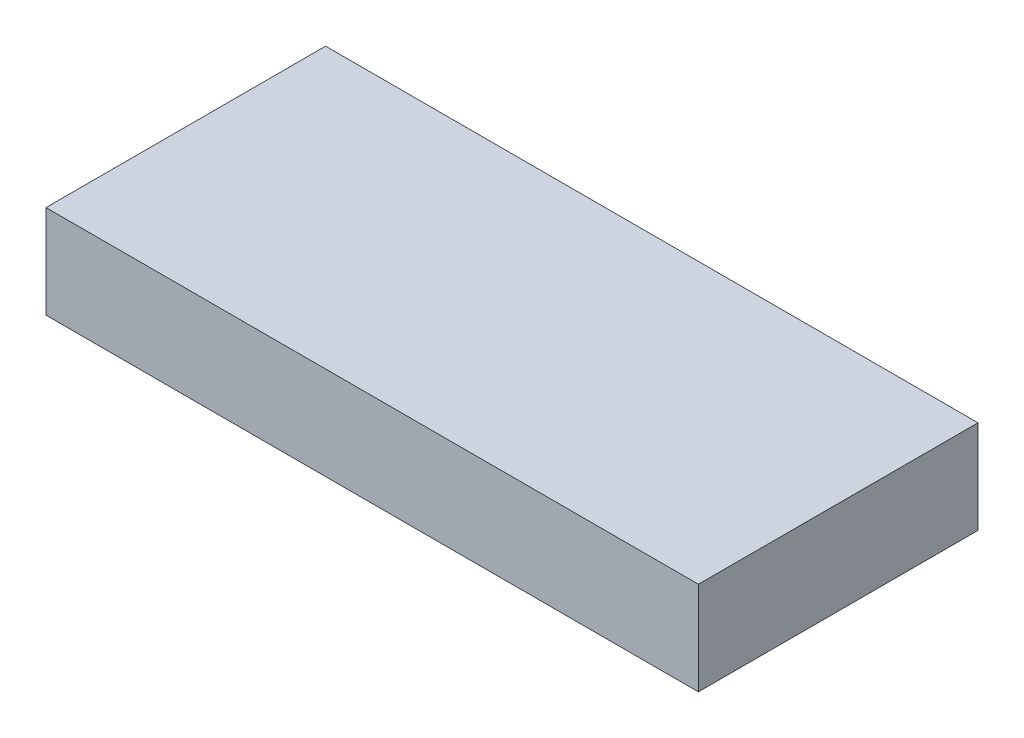
ISO-10303-21;
HEADER;
FILE_DESCRIPTION(('STEP AP214'),'2;1');
FILE_NAME('part.step','',(''),(''),'','','');
FILE_SCHEMA(('AUTOMOTIVE_DESIGN { 1 0 10303 214 1 1 1 1 }'));
ENDSEC;
DATA;
#1=APPLICATION_CONTEXT('core data for automotive mechanical design processes');
#2=APPLICATION_PROTOCOL_DEFINITION('international standard','automotive_design',2000,#1);
#3=PRODUCT_CONTEXT('',#1,'mechanical');
#4=PRODUCT('Part','Part','',(#3));
#5=PRODUCT_RELATED_PRODUCT_CATEGORY('part','',(#4));
#6=PRODUCT_DEFINITION_FORMATION('','',#4);
#7=PRODUCT_DEFINITION_CONTEXT('part definition',#1,'design');
#8=PRODUCT_DEFINITION('design','',#6,#7);
#9=PRODUCT_DEFINITION_SHAPE('','',#8);
#10=(LENGTH_UNIT() NAMED_UNIT(*) SI_UNIT(.MILLI.,.METRE.));
#11=(NAMED_UNIT(*) PLANE_ANGLE_UNIT() SI_UNIT($,.RADIAN.));
#12=(NAMED_UNIT(*) SI_UNIT($,.STERADIAN.) SOLID_ANGLE_UNIT());
#13=UNCERTAINTY_MEASURE_WITH_UNIT(LENGTH_MEASURE(1.E-05),#10,'distance_accuracy_value','');
#14=(GEOMETRIC_REPRESENTATION_CONTEXT(3) GLOBAL_UNCERTAINTY_ASSIGNED_CONTEXT((#13)) GLOBAL_UNIT_ASSIGNED_CONTEXT((#10,
#11,#12)) REPRESENTATION_CONTEXT('',''));
#15=CARTESIAN_POINT('',(0.,0.,0.));
#16=DIRECTION('',(0.,0.,1.));
#17=DIRECTION('',(1.,0.,0.));
#18=AXIS2_PLACEMENT_3D('',#15,#16,#17);
#19=CARTESIAN_POINT('',(17.5,5.,-7.5));
#20=DIRECTION('',(-1.,0.,0.));
#21=DIRECTION('',(0.,0.,1.));
#22=AXIS2_PLACEMENT_3D('',#19,#20,#21);
#23=PLANE('',#22);
#24=DIRECTION('',(0.,0.,-1.));
#25=VECTOR('',#24,1.);
#26=CARTESIAN_POINT('',(17.5,0.,-7.5));
#27=LINE('',#26,#25);
#28=CARTESIAN_POINT('',(17.5,0.,7.50000000000001));
#29=VERTEX_POINT('',#28);
#30=CARTESIAN_POINT('',(17.5,0.,-7.5));
#31=VERTEX_POINT('',#30);
#32=EDGE_CURVE('E111',#29,#31,#27,.T.);
#33=ORIENTED_EDGE('',*,*,#32,.T.);
#34=DIRECTION('',(0.,-1.,0.));
#35=VECTOR('',#34,1.);
#36=CARTESIAN_POINT('',(17.5,5.,-7.5));
#37=LINE('',#36,#35);
#38=CARTESIAN_POINT('',(17.5,5.,-7.5));
#39=VERTEX_POINT('',#38);
#40=EDGE_CURVE('E11',#39,#31,#37,.T.);
#41=ORIENTED_EDGE('',*,*,#40,.F.);
#42=DIRECTION('',(0.,0.,-1.));
#43=VECTOR('',#42,1.);
#44=CARTESIAN_POINT('',(17.5,5.,-7.5));
#45=LINE('',#44,#43);
#46=CARTESIAN_POINT('',(17.5,5.,7.50000000000001));
#47=VERTEX_POINT('',#46);
#48=EDGE_CURVE('E95',#47,#39,#45,.T.);
#49=ORIENTED_EDGE('',*,*,#48,.F.);
#50=DIRECTION('',(0.,-1.,0.));
#51=VECTOR('',#50,1.);
#52=CARTESIAN_POINT('',(17.5,5.,7.50000000000001));
#53=LINE('',#52,#51);
#54=EDGE_CURVE('E107',#47,#29,#53,.T.);
#55=ORIENTED_EDGE('',*,*,#54,.T.);
#56=EDGE_LOOP('',(#33,#41,#49,#55));
#57=FACE_BOUND('',#56,.T.);
#58=ADVANCED_FACE('F43',(#57),#23,.F.);
#59=CARTESIAN_POINT('',(-17.5,5.,-7.5));
#60=DIRECTION('',(0.,0.,1.));
#61=DIRECTION('',(1.,0.,0.));
#62=AXIS2_PLACEMENT_3D('',#59,#60,#61);
#63=PLANE('',#62);
#64=DIRECTION('',(-1.,0.,0.));
#65=VECTOR('',#64,1.);
#66=CARTESIAN_POINT('',(-17.5,0.,-7.5));
#67=LINE('',#66,#65);
#68=CARTESIAN_POINT('',(-17.5,0.,-7.5));
#69=VERTEX_POINT('',#68);
#70=EDGE_CURVE('E100',#31,#69,#67,.T.);
#71=ORIENTED_EDGE('',*,*,#70,.T.);
#72=DIRECTION('',(0.,-1.,0.));
#73=VECTOR('',#72,1.);
#74=CARTESIAN_POINT('',(-17.5,5.,-7.5));
#75=LINE('',#74,#73);
#76=CARTESIAN_POINT('',(-17.5,5.,-7.5));
#77=VERTEX_POINT('',#76);
#78=EDGE_CURVE('E52',#77,#69,#75,.T.);
#79=ORIENTED_EDGE('',*,*,#78,.F.);
#80=DIRECTION('',(-1.,0.,0.));
#81=VECTOR('',#80,1.);
#82=CARTESIAN_POINT('',(-17.5,5.,-7.5));
#83=LINE('',#82,#81);
#84=EDGE_CURVE('E90',#39,#77,#83,.T.);
#85=ORIENTED_EDGE('',*,*,#84,.F.);
#86=ORIENTED_EDGE('',*,*,#40,.T.);
#87=EDGE_LOOP('',(#71,#79,#85,#86));
#88=FACE_BOUND('',#87,.T.);
#89=ADVANCED_FACE('F99',(#88),#63,.F.);
#90=CARTESIAN_POINT('',(-17.5,5.,-7.5));
#91=DIRECTION('',(1.,0.,0.));
#92=DIRECTION('',(0.,0.,-1.));
#93=AXIS2_PLACEMENT_3D('',#90,#91,#92);
#94=PLANE('',#93);
#95=DIRECTION('',(0.,0.,1.));
#96=VECTOR('',#95,1.);
#97=CARTESIAN_POINT('',(-17.5,0.,-7.5));
#98=LINE('',#97,#96);
#99=CARTESIAN_POINT('',(-17.5,0.,7.50000000000001));
#100=VERTEX_POINT('',#99);
#101=EDGE_CURVE('E77',#69,#100,#98,.T.);
#102=ORIENTED_EDGE('',*,*,#101,.T.);
#103=DIRECTION('',(0.,-1.,0.));
#104=VECTOR('',#103,1.);
#105=CARTESIAN_POINT('',(-17.5,5.,7.50000000000001));
#106=LINE('',#105,#104);
#107=CARTESIAN_POINT('',(-17.5,5.,7.50000000000001));
#108=VERTEX_POINT('',#107);
#109=EDGE_CURVE('E102',#108,#100,#106,.T.);
#110=ORIENTED_EDGE('',*,*,#109,.F.);
#111=DIRECTION('',(0.,0.,1.));
#112=VECTOR('',#111,1.);
#113=CARTESIAN_POINT('',(-17.5,5.,-7.5));
#114=LINE('',#113,#112);
#115=EDGE_CURVE('E93',#77,#108,#114,.T.);
#116=ORIENTED_EDGE('',*,*,#115,.F.);
#117=ORIENTED_EDGE('',*,*,#78,.T.);
#118=EDGE_LOOP('',(#102,#110,#116,#117));
#119=FACE_BOUND('',#118,.T.);
#120=ADVANCED_FACE('F103',(#119),#94,.F.);
#121=CARTESIAN_POINT('',(-17.5,5.,7.50000000000001));
#122=DIRECTION('',(0.,0.,-1.));
#123=DIRECTION('',(-1.,0.,0.));
#124=AXIS2_PLACEMENT_3D('',#121,#122,#123);
#125=PLANE('',#124);
#126=DIRECTION('',(1.,0.,0.));
#127=VECTOR('',#126,1.);
#128=CARTESIAN_POINT('',(-17.5,0.,7.50000000000001));
#129=LINE('',#128,#127);
#130=EDGE_CURVE('E83',#100,#29,#129,.T.);
#131=ORIENTED_EDGE('',*,*,#130,.T.);
#132=ORIENTED_EDGE('',*,*,#54,.F.);
#133=DIRECTION('',(1.,0.,0.));
#134=VECTOR('',#133,1.);
#135=CARTESIAN_POINT('',(-17.5,5.,7.50000000000001));
#136=LINE('',#135,#134);
#137=EDGE_CURVE('E60',#108,#47,#136,.T.);
#138=ORIENTED_EDGE('',*,*,#137,.F.);
#139=ORIENTED_EDGE('',*,*,#109,.T.);
#140=EDGE_LOOP('',(#131,#132,#138,#139));
#141=FACE_BOUND('',#140,.T.);
#142=ADVANCED_FACE('F124',(#141),#125,.F.);
#143=CARTESIAN_POINT('',(0.,5.,0.));
#144=DIRECTION('',(0.,1.,0.));
#145=DIRECTION('',(0.,0.,1.));
#146=AXIS2_PLACEMENT_3D('',#143,#144,#145);
#147=PLANE('',#146);
#148=ORIENTED_EDGE('',*,*,#48,.T.);
#149=ORIENTED_EDGE('',*,*,#84,.T.);
#150=ORIENTED_EDGE('',*,*,#115,.T.);
#151=ORIENTED_EDGE('',*,*,#137,.T.);
#152=EDGE_LOOP('',(#148,#149,#150,#151));
#153=FACE_BOUND('',#152,.T.);
#154=ADVANCED_FACE('F91',(#153),#147,.T.);
#155=CARTESIAN_POINT('',(0.,0.,0.));
#156=DIRECTION('',(0.,1.,0.));
#157=DIRECTION('',(0.,0.,1.));
#158=AXIS2_PLACEMENT_3D('',#155,#156,#157);
#159=PLANE('',#158);
#160=ORIENTED_EDGE('',*,*,#32,.F.);
#161=ORIENTED_EDGE('',*,*,#130,.F.);
#162=ORIENTED_EDGE('',*,*,#101,.F.);
#163=ORIENTED_EDGE('',*,*,#70,.F.);
#164=EDGE_LOOP('',(#160,#161,#162,#163));
#165=FACE_BOUND('',#164,.T.);
#166=ADVANCED_FACE('F127',(#165),#159,.F.);
#167=CLOSED_SHELL('',(#58,#89,#120,#142,#154,#166));
#168=MANIFOLD_SOLID_BREP('B2',#167);
#169=ADVANCED_BREP_SHAPE_REPRESENTATION('',(#18,#168),#14);
#170=SHAPE_DEFINITION_REPRESENTATION(#9,#169);
ENDSEC;
END-ISO-10303-21;
